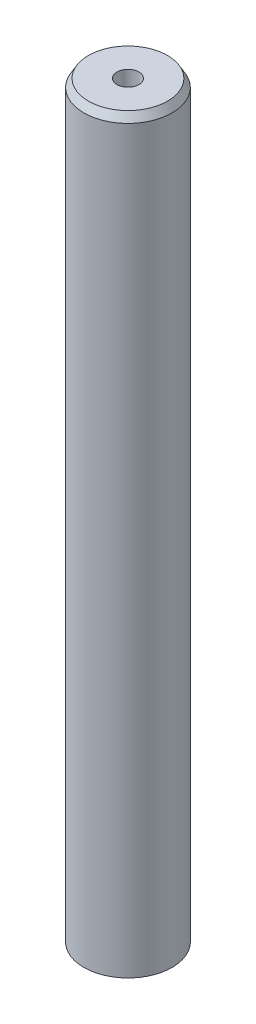
ISO-10303-21;
HEADER;
FILE_DESCRIPTION(('STEP AP214'),'2;1');
FILE_NAME('part.step','',(''),(''),'','','');
FILE_SCHEMA(('AUTOMOTIVE_DESIGN { 1 0 10303 214 1 1 1 1 }'));
ENDSEC;
DATA;
#1=APPLICATION_CONTEXT('core data for automotive mechanical design processes');
#2=APPLICATION_PROTOCOL_DEFINITION('international standard','automotive_design',2000,#1);
#3=PRODUCT_CONTEXT('',#1,'mechanical');
#4=PRODUCT('Part','Part','',(#3));
#5=PRODUCT_RELATED_PRODUCT_CATEGORY('part','',(#4));
#6=PRODUCT_DEFINITION_FORMATION('','',#4);
#7=PRODUCT_DEFINITION_CONTEXT('part definition',#1,'design');
#8=PRODUCT_DEFINITION('design','',#6,#7);
#9=PRODUCT_DEFINITION_SHAPE('','',#8);
#10=(LENGTH_UNIT() NAMED_UNIT(*) SI_UNIT(.MILLI.,.METRE.));
#11=(NAMED_UNIT(*) PLANE_ANGLE_UNIT() SI_UNIT($,.RADIAN.));
#12=(NAMED_UNIT(*) SI_UNIT($,.STERADIAN.) SOLID_ANGLE_UNIT());
#13=UNCERTAINTY_MEASURE_WITH_UNIT(LENGTH_MEASURE(1.E-05),#10,'distance_accuracy_value','');
#14=(GEOMETRIC_REPRESENTATION_CONTEXT(3) GLOBAL_UNCERTAINTY_ASSIGNED_CONTEXT((#13)) GLOBAL_UNIT_ASSIGNED_CONTEXT((#10,
#11,#12)) REPRESENTATION_CONTEXT('',''));
#15=CARTESIAN_POINT('',(0.,0.,0.));
#16=DIRECTION('',(0.,0.,1.));
#17=DIRECTION('',(1.,0.,0.));
#18=AXIS2_PLACEMENT_3D('',#15,#16,#17);
#19=CARTESIAN_POINT('',(0.,85.2774578427584,0.));
#20=DIRECTION('',(0.,-1.,0.));
#21=DIRECTION('',(0.,0.,-1.));
#22=AXIS2_PLACEMENT_3D('',#19,#20,#21);
#23=CYLINDRICAL_SURFACE('',#22,5.);
#24=CARTESIAN_POINT('',(0.,84.3814254008256,0.));
#25=DIRECTION('',(0.,1.,0.));
#26=DIRECTION('',(0.,0.,1.));
#27=AXIS2_PLACEMENT_3D('',#24,#25,#26);
#28=CIRCLE('',#27,5.);
#29=CARTESIAN_POINT('',(0.,84.3814254008256,5.));
#30=VERTEX_POINT('',#29);
#31=EDGE_CURVE('E50',#30,#30,#28,.F.);
#32=ORIENTED_EDGE('',*,*,#31,.T.);
#33=EDGE_LOOP('',(#32));
#34=FACE_BOUND('',#33,.T.);
#35=CARTESIAN_POINT('',(0.,0.517324571552583,0.));
#36=DIRECTION('',(0.,1.,0.));
#37=DIRECTION('',(0.,0.,1.));
#38=AXIS2_PLACEMENT_3D('',#35,#36,#37);
#39=CIRCLE('',#38,5.);
#40=CARTESIAN_POINT('',(0.,0.517324571552583,5.));
#41=VERTEX_POINT('',#40);
#42=EDGE_CURVE('E51',#41,#41,#39,.T.);
#43=ORIENTED_EDGE('',*,*,#42,.T.);
#44=EDGE_LOOP('',(#43));
#45=FACE_BOUND('',#44,.T.);
#46=ADVANCED_FACE('F39',(#34,#45),#23,.T.);
#47=CARTESIAN_POINT('',(0.,85.2774578427584,0.));
#48=DIRECTION('',(0.,1.,0.));
#49=DIRECTION('',(0.,0.,1.));
#50=AXIS2_PLACEMENT_3D('',#47,#48,#49);
#51=PLANE('',#50);
#52=CARTESIAN_POINT('',(0.,85.2774578427584,0.));
#53=DIRECTION('',(0.,1.,0.));
#54=DIRECTION('',(0.,0.,1.));
#55=AXIS2_PLACEMENT_3D('',#52,#53,#54);
#56=CIRCLE('',#55,4.48267542844744);
#57=CARTESIAN_POINT('',(0.,85.2774578427584,4.48267542844744));
#58=VERTEX_POINT('',#57);
#59=EDGE_CURVE('E54',#58,#58,#56,.T.);
#60=ORIENTED_EDGE('',*,*,#59,.T.);
#61=EDGE_LOOP('',(#60));
#62=FACE_BOUND('',#61,.T.);
#63=CARTESIAN_POINT('',(0.,85.2774578427584,0.));
#64=DIRECTION('',(0.,1.,0.));
#65=DIRECTION('',(0.,0.,1.));
#66=AXIS2_PLACEMENT_3D('',#63,#64,#65);
#67=CIRCLE('',#66,1.24344374985578);
#68=CARTESIAN_POINT('',(0.,85.2774578427584,1.24344374985578));
#69=VERTEX_POINT('',#68);
#70=EDGE_CURVE('E58',#69,#69,#67,.T.);
#71=ORIENTED_EDGE('',*,*,#70,.F.);
#72=EDGE_LOOP('',(#71));
#73=FACE_BOUND('',#72,.T.);
#74=ADVANCED_FACE('F69',(#62,#73),#51,.T.);
#75=CARTESIAN_POINT('',(0.,0.,0.));
#76=DIRECTION('',(0.,1.,0.));
#77=DIRECTION('',(0.,0.,1.));
#78=AXIS2_PLACEMENT_3D('',#75,#76,#77);
#79=PLANE('',#78);
#80=CARTESIAN_POINT('',(0.,0.,0.));
#81=DIRECTION('',(0.,1.,0.));
#82=DIRECTION('',(0.,0.,1.));
#83=AXIS2_PLACEMENT_3D('',#80,#81,#82);
#84=CIRCLE('',#83,4.10396755806713);
#85=CARTESIAN_POINT('',(0.,0.,4.10396755806713));
#86=VERTEX_POINT('',#85);
#87=EDGE_CURVE('E10',#86,#86,#84,.F.);
#88=ORIENTED_EDGE('',*,*,#87,.T.);
#89=EDGE_LOOP('',(#88));
#90=FACE_BOUND('',#89,.T.);
#91=CARTESIAN_POINT('',(0.,0.,0.));
#92=DIRECTION('',(0.,1.,0.));
#93=DIRECTION('',(0.,0.,1.));
#94=AXIS2_PLACEMENT_3D('',#91,#92,#93);
#95=CIRCLE('',#94,1.24344374985578);
#96=CARTESIAN_POINT('',(0.,0.,1.24344374985578));
#97=VERTEX_POINT('',#96);
#98=EDGE_CURVE('E63',#97,#97,#95,.T.);
#99=ORIENTED_EDGE('',*,*,#98,.T.);
#100=EDGE_LOOP('',(#99));
#101=FACE_BOUND('',#100,.T.);
#102=ADVANCED_FACE('F75',(#90,#101),#79,.F.);
#103=CARTESIAN_POINT('',(0.,85.2774578427584,0.));
#104=DIRECTION('',(0.,-1.,0.));
#105=DIRECTION('',(0.,0.,-1.));
#106=AXIS2_PLACEMENT_3D('',#103,#104,#105);
#107=CYLINDRICAL_SURFACE('',#106,1.24344374985578);
#108=ORIENTED_EDGE('',*,*,#70,.T.);
#109=EDGE_LOOP('',(#108));
#110=FACE_BOUND('',#109,.T.);
#111=ORIENTED_EDGE('',*,*,#98,.F.);
#112=EDGE_LOOP('',(#111));
#113=FACE_BOUND('',#112,.T.);
#114=ADVANCED_FACE('F70',(#110,#113),#107,.F.);
#115=CARTESIAN_POINT('',(0.,85.2774578427584,0.));
#116=DIRECTION('',(0.,-1.,0.));
#117=DIRECTION('',(0.,0.,-1.));
#118=AXIS2_PLACEMENT_3D('',#115,#116,#117);
#119=CONICAL_SURFACE('',#118,4.48267542844744,0.523598775598293);
#120=ORIENTED_EDGE('',*,*,#31,.F.);
#121=EDGE_LOOP('',(#120));
#122=FACE_BOUND('',#121,.T.);
#123=ORIENTED_EDGE('',*,*,#59,.F.);
#124=EDGE_LOOP('',(#123));
#125=FACE_BOUND('',#124,.T.);
#126=ADVANCED_FACE('F81',(#122,#125),#119,.T.);
#127=CARTESIAN_POINT('',(0.,0.517324571552583,0.));
#128=DIRECTION('',(0.,1.,0.));
#129=DIRECTION('',(0.,0.,1.));
#130=AXIS2_PLACEMENT_3D('',#127,#128,#129);
#131=CONICAL_SURFACE('',#130,5.,1.04719755119659);
#132=ORIENTED_EDGE('',*,*,#87,.F.);
#133=EDGE_LOOP('',(#132));
#134=FACE_BOUND('',#133,.T.);
#135=ORIENTED_EDGE('',*,*,#42,.F.);
#136=EDGE_LOOP('',(#135));
#137=FACE_BOUND('',#136,.T.);
#138=ADVANCED_FACE('F45',(#134,#137),#131,.T.);
#139=CLOSED_SHELL('',(#46,#74,#102,#114,#126,#138));
#140=MANIFOLD_SOLID_BREP('B2',#139);
#141=ADVANCED_BREP_SHAPE_REPRESENTATION('',(#18,#140),#14);
#142=SHAPE_DEFINITION_REPRESENTATION(#9,#141);
ENDSEC;
END-ISO-10303-21;
